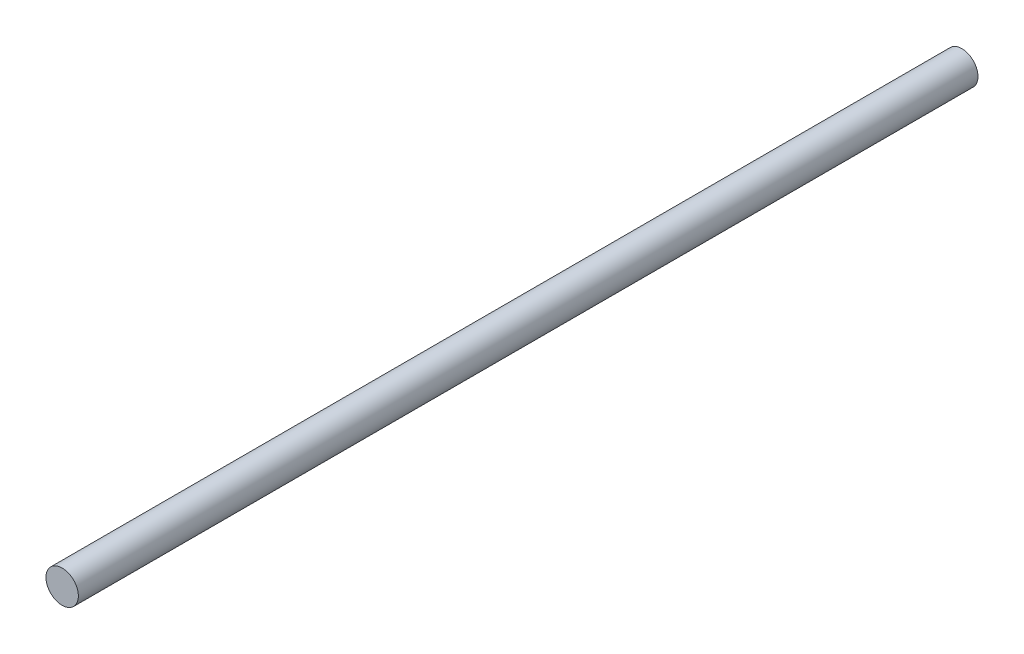
ISO-10303-21;
HEADER;
FILE_DESCRIPTION(('STEP AP214'),'2;1');
FILE_NAME('part.step','',(''),(''),'','','');
FILE_SCHEMA(('AUTOMOTIVE_DESIGN { 1 0 10303 214 1 1 1 1 }'));
ENDSEC;
DATA;
#1=APPLICATION_CONTEXT('core data for automotive mechanical design processes');
#2=APPLICATION_PROTOCOL_DEFINITION('international standard','automotive_design',2000,#1);
#3=PRODUCT_CONTEXT('',#1,'mechanical');
#4=PRODUCT('Part','Part','',(#3));
#5=PRODUCT_RELATED_PRODUCT_CATEGORY('part','',(#4));
#6=PRODUCT_DEFINITION_FORMATION('','',#4);
#7=PRODUCT_DEFINITION_CONTEXT('part definition',#1,'design');
#8=PRODUCT_DEFINITION('design','',#6,#7);
#9=PRODUCT_DEFINITION_SHAPE('','',#8);
#10=(LENGTH_UNIT() NAMED_UNIT(*) SI_UNIT(.MILLI.,.METRE.));
#11=(NAMED_UNIT(*) PLANE_ANGLE_UNIT() SI_UNIT($,.RADIAN.));
#12=(NAMED_UNIT(*) SI_UNIT($,.STERADIAN.) SOLID_ANGLE_UNIT());
#13=UNCERTAINTY_MEASURE_WITH_UNIT(LENGTH_MEASURE(1.E-05),#10,'distance_accuracy_value','');
#14=(GEOMETRIC_REPRESENTATION_CONTEXT(3) GLOBAL_UNCERTAINTY_ASSIGNED_CONTEXT((#13)) GLOBAL_UNIT_ASSIGNED_CONTEXT((#10,
#11,#12)) REPRESENTATION_CONTEXT('',''));
#15=CARTESIAN_POINT('',(0.,0.,0.));
#16=DIRECTION('',(0.,0.,1.));
#17=DIRECTION('',(1.,0.,0.));
#18=AXIS2_PLACEMENT_3D('',#15,#16,#17);
#19=CARTESIAN_POINT('',(0.,0.,500.));
#20=DIRECTION('',(0.,0.,-1.));
#21=DIRECTION('',(-1.,0.,0.));
#22=AXIS2_PLACEMENT_3D('',#19,#20,#21);
#23=CYLINDRICAL_SURFACE('',#22,9.);
#24=CARTESIAN_POINT('',(0.,0.,500.));
#25=DIRECTION('',(0.,0.,1.));
#26=DIRECTION('',(1.,0.,0.));
#27=AXIS2_PLACEMENT_3D('',#24,#25,#26);
#28=CIRCLE('',#27,9.);
#29=CARTESIAN_POINT('',(9.,0.,500.));
#30=VERTEX_POINT('',#29);
#31=EDGE_CURVE('E10',#30,#30,#28,.T.);
#32=ORIENTED_EDGE('',*,*,#31,.F.);
#33=EDGE_LOOP('',(#32));
#34=FACE_BOUND('',#33,.T.);
#35=CARTESIAN_POINT('',(0.,0.,0.));
#36=DIRECTION('',(0.,0.,1.));
#37=DIRECTION('',(1.,0.,0.));
#38=AXIS2_PLACEMENT_3D('',#35,#36,#37);
#39=CIRCLE('',#38,9.);
#40=CARTESIAN_POINT('',(9.,0.,0.));
#41=VERTEX_POINT('',#40);
#42=EDGE_CURVE('E34',#41,#41,#39,.T.);
#43=ORIENTED_EDGE('',*,*,#42,.T.);
#44=EDGE_LOOP('',(#43));
#45=FACE_BOUND('',#44,.T.);
#46=ADVANCED_FACE('F31',(#34,#45),#23,.T.);
#47=CARTESIAN_POINT('',(0.,0.,500.));
#48=DIRECTION('',(0.,0.,1.));
#49=DIRECTION('',(1.,0.,0.));
#50=AXIS2_PLACEMENT_3D('',#47,#48,#49);
#51=PLANE('',#50);
#52=ORIENTED_EDGE('',*,*,#31,.T.);
#53=EDGE_LOOP('',(#52));
#54=FACE_BOUND('',#53,.T.);
#55=ADVANCED_FACE('F46',(#54),#51,.T.);
#56=CARTESIAN_POINT('',(0.,0.,0.));
#57=DIRECTION('',(0.,0.,1.));
#58=DIRECTION('',(1.,0.,0.));
#59=AXIS2_PLACEMENT_3D('',#56,#57,#58);
#60=PLANE('',#59);
#61=ORIENTED_EDGE('',*,*,#42,.F.);
#62=EDGE_LOOP('',(#61));
#63=FACE_BOUND('',#62,.T.);
#64=ADVANCED_FACE('F44',(#63),#60,.F.);
#65=CLOSED_SHELL('',(#46,#55,#64));
#66=MANIFOLD_SOLID_BREP('B2',#65);
#67=ADVANCED_BREP_SHAPE_REPRESENTATION('',(#18,#66),#14);
#68=SHAPE_DEFINITION_REPRESENTATION(#9,#67);
ENDSEC;
END-ISO-10303-21;
